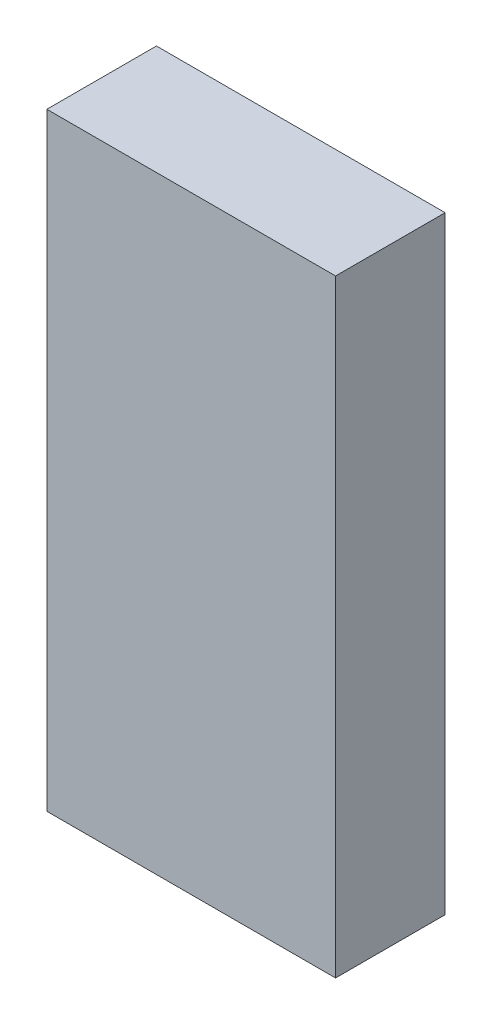
ISO-10303-21;
HEADER;
FILE_DESCRIPTION(('STEP AP214'),'2;1');
FILE_NAME('part.step','',(''),(''),'','','');
FILE_SCHEMA(('AUTOMOTIVE_DESIGN { 1 0 10303 214 1 1 1 1 }'));
ENDSEC;
DATA;
#1=APPLICATION_CONTEXT('core data for automotive mechanical design processes');
#2=APPLICATION_PROTOCOL_DEFINITION('international standard','automotive_design',2000,#1);
#3=PRODUCT_CONTEXT('',#1,'mechanical');
#4=PRODUCT('Part','Part','',(#3));
#5=PRODUCT_RELATED_PRODUCT_CATEGORY('part','',(#4));
#6=PRODUCT_DEFINITION_FORMATION('','',#4);
#7=PRODUCT_DEFINITION_CONTEXT('part definition',#1,'design');
#8=PRODUCT_DEFINITION('design','',#6,#7);
#9=PRODUCT_DEFINITION_SHAPE('','',#8);
#10=(LENGTH_UNIT() NAMED_UNIT(*) SI_UNIT(.MILLI.,.METRE.));
#11=(NAMED_UNIT(*) PLANE_ANGLE_UNIT() SI_UNIT($,.RADIAN.));
#12=(NAMED_UNIT(*) SI_UNIT($,.STERADIAN.) SOLID_ANGLE_UNIT());
#13=UNCERTAINTY_MEASURE_WITH_UNIT(LENGTH_MEASURE(1.E-05),#10,'distance_accuracy_value','');
#14=(GEOMETRIC_REPRESENTATION_CONTEXT(3) GLOBAL_UNCERTAINTY_ASSIGNED_CONTEXT((#13)) GLOBAL_UNIT_ASSIGNED_CONTEXT((#10,
#11,#12)) REPRESENTATION_CONTEXT('',''));
#15=CARTESIAN_POINT('',(0.,0.,0.));
#16=DIRECTION('',(0.,0.,1.));
#17=DIRECTION('',(1.,0.,0.));
#18=AXIS2_PLACEMENT_3D('',#15,#16,#17);
#19=CARTESIAN_POINT('',(0.,0.,6.35));
#20=DIRECTION('',(1.,0.,0.));
#21=DIRECTION('',(0.,0.,-1.));
#22=AXIS2_PLACEMENT_3D('',#19,#20,#21);
#23=PLANE('',#22);
#24=DIRECTION('',(0.,-1.,0.));
#25=VECTOR('',#24,1.);
#26=CARTESIAN_POINT('',(0.,0.,0.));
#27=LINE('',#26,#25);
#28=CARTESIAN_POINT('',(0.,0.,0.));
#29=VERTEX_POINT('',#28);
#30=CARTESIAN_POINT('',(0.,-35.2362745098039,0.));
#31=VERTEX_POINT('',#30);
#32=EDGE_CURVE('E102',#29,#31,#27,.T.);
#33=ORIENTED_EDGE('',*,*,#32,.T.);
#34=DIRECTION('',(0.,0.,-1.));
#35=VECTOR('',#34,1.);
#36=CARTESIAN_POINT('',(0.,-35.2362745098039,6.35));
#37=LINE('',#36,#35);
#38=CARTESIAN_POINT('',(0.,-35.2362745098039,6.35));
#39=VERTEX_POINT('',#38);
#40=EDGE_CURVE('E11',#39,#31,#37,.T.);
#41=ORIENTED_EDGE('',*,*,#40,.F.);
#42=DIRECTION('',(0.,-1.,0.));
#43=VECTOR('',#42,1.);
#44=CARTESIAN_POINT('',(0.,0.,6.35));
#45=LINE('',#44,#43);
#46=CARTESIAN_POINT('',(0.,0.,6.35));
#47=VERTEX_POINT('',#46);
#48=EDGE_CURVE('E90',#47,#39,#45,.T.);
#49=ORIENTED_EDGE('',*,*,#48,.F.);
#50=DIRECTION('',(0.,0.,-1.));
#51=VECTOR('',#50,1.);
#52=CARTESIAN_POINT('',(0.,0.,6.35));
#53=LINE('',#52,#51);
#54=EDGE_CURVE('E98',#47,#29,#53,.T.);
#55=ORIENTED_EDGE('',*,*,#54,.T.);
#56=EDGE_LOOP('',(#33,#41,#49,#55));
#57=FACE_BOUND('',#56,.T.);
#58=ADVANCED_FACE('F39',(#57),#23,.F.);
#59=CARTESIAN_POINT('',(0.,-35.2362745098039,6.35));
#60=DIRECTION('',(0.,1.,0.));
#61=DIRECTION('',(0.,0.,1.));
#62=AXIS2_PLACEMENT_3D('',#59,#60,#61);
#63=PLANE('',#62);
#64=DIRECTION('',(1.,0.,0.));
#65=VECTOR('',#64,1.);
#66=CARTESIAN_POINT('',(0.,-35.2362745098039,0.));
#67=LINE('',#66,#65);
#68=CARTESIAN_POINT('',(16.7322668256492,-35.2362745098039,0.));
#69=VERTEX_POINT('',#68);
#70=EDGE_CURVE('E94',#31,#69,#67,.T.);
#71=ORIENTED_EDGE('',*,*,#70,.T.);
#72=DIRECTION('',(0.,0.,-1.));
#73=VECTOR('',#72,1.);
#74=CARTESIAN_POINT('',(16.7322668256492,-35.2362745098039,6.35));
#75=LINE('',#74,#73);
#76=CARTESIAN_POINT('',(16.7322668256492,-35.2362745098039,6.35));
#77=VERTEX_POINT('',#76);
#78=EDGE_CURVE('E47',#77,#69,#75,.T.);
#79=ORIENTED_EDGE('',*,*,#78,.F.);
#80=DIRECTION('',(1.,0.,0.));
#81=VECTOR('',#80,1.);
#82=CARTESIAN_POINT('',(0.,-35.2362745098039,6.35));
#83=LINE('',#82,#81);
#84=EDGE_CURVE('E85',#39,#77,#83,.T.);
#85=ORIENTED_EDGE('',*,*,#84,.F.);
#86=ORIENTED_EDGE('',*,*,#40,.T.);
#87=EDGE_LOOP('',(#71,#79,#85,#86));
#88=FACE_BOUND('',#87,.T.);
#89=ADVANCED_FACE('F93',(#88),#63,.F.);
#90=CARTESIAN_POINT('',(16.7322668256492,0.,6.35));
#91=DIRECTION('',(-1.,0.,0.));
#92=DIRECTION('',(0.,0.,1.));
#93=AXIS2_PLACEMENT_3D('',#90,#91,#92);
#94=PLANE('',#93);
#95=DIRECTION('',(0.,1.,0.));
#96=VECTOR('',#95,1.);
#97=CARTESIAN_POINT('',(16.7322668256492,0.,0.));
#98=LINE('',#97,#96);
#99=CARTESIAN_POINT('',(16.7322668256492,0.,0.));
#100=VERTEX_POINT('',#99);
#101=EDGE_CURVE('E72',#69,#100,#98,.T.);
#102=ORIENTED_EDGE('',*,*,#101,.T.);
#103=DIRECTION('',(0.,0.,-1.));
#104=VECTOR('',#103,1.);
#105=CARTESIAN_POINT('',(16.7322668256492,0.,6.35));
#106=LINE('',#105,#104);
#107=CARTESIAN_POINT('',(16.7322668256492,0.,6.35));
#108=VERTEX_POINT('',#107);
#109=EDGE_CURVE('E95',#108,#100,#106,.T.);
#110=ORIENTED_EDGE('',*,*,#109,.F.);
#111=DIRECTION('',(0.,1.,0.));
#112=VECTOR('',#111,1.);
#113=CARTESIAN_POINT('',(16.7322668256492,0.,6.35));
#114=LINE('',#113,#112);
#115=EDGE_CURVE('E88',#77,#108,#114,.T.);
#116=ORIENTED_EDGE('',*,*,#115,.F.);
#117=ORIENTED_EDGE('',*,*,#78,.T.);
#118=EDGE_LOOP('',(#102,#110,#116,#117));
#119=FACE_BOUND('',#118,.T.);
#120=ADVANCED_FACE('F96',(#119),#94,.F.);
#121=CARTESIAN_POINT('',(0.,0.,6.35));
#122=DIRECTION('',(0.,-1.,0.));
#123=DIRECTION('',(0.,0.,-1.));
#124=AXIS2_PLACEMENT_3D('',#121,#122,#123);
#125=PLANE('',#124);
#126=DIRECTION('',(-1.,0.,0.));
#127=VECTOR('',#126,1.);
#128=CARTESIAN_POINT('',(0.,0.,0.));
#129=LINE('',#128,#127);
#130=EDGE_CURVE('E78',#100,#29,#129,.T.);
#131=ORIENTED_EDGE('',*,*,#130,.T.);
#132=ORIENTED_EDGE('',*,*,#54,.F.);
#133=DIRECTION('',(-1.,0.,0.));
#134=VECTOR('',#133,1.);
#135=CARTESIAN_POINT('',(0.,0.,6.35));
#136=LINE('',#135,#134);
#137=EDGE_CURVE('E55',#108,#47,#136,.T.);
#138=ORIENTED_EDGE('',*,*,#137,.F.);
#139=ORIENTED_EDGE('',*,*,#109,.T.);
#140=EDGE_LOOP('',(#131,#132,#138,#139));
#141=FACE_BOUND('',#140,.T.);
#142=ADVANCED_FACE('F109',(#141),#125,.F.);
#143=CARTESIAN_POINT('',(0.,0.,6.35));
#144=DIRECTION('',(0.,0.,1.));
#145=DIRECTION('',(1.,0.,0.));
#146=AXIS2_PLACEMENT_3D('',#143,#144,#145);
#147=PLANE('',#146);
#148=ORIENTED_EDGE('',*,*,#48,.T.);
#149=ORIENTED_EDGE('',*,*,#84,.T.);
#150=ORIENTED_EDGE('',*,*,#115,.T.);
#151=ORIENTED_EDGE('',*,*,#137,.T.);
#152=EDGE_LOOP('',(#148,#149,#150,#151));
#153=FACE_BOUND('',#152,.T.);
#154=ADVANCED_FACE('F86',(#153),#147,.T.);
#155=CARTESIAN_POINT('',(0.,0.,0.));
#156=DIRECTION('',(0.,0.,1.));
#157=DIRECTION('',(1.,0.,0.));
#158=AXIS2_PLACEMENT_3D('',#155,#156,#157);
#159=PLANE('',#158);
#160=ORIENTED_EDGE('',*,*,#32,.F.);
#161=ORIENTED_EDGE('',*,*,#130,.F.);
#162=ORIENTED_EDGE('',*,*,#101,.F.);
#163=ORIENTED_EDGE('',*,*,#70,.F.);
#164=EDGE_LOOP('',(#160,#161,#162,#163));
#165=FACE_BOUND('',#164,.T.);
#166=ADVANCED_FACE('F112',(#165),#159,.F.);
#167=CLOSED_SHELL('',(#58,#89,#120,#142,#154,#166));
#168=MANIFOLD_SOLID_BREP('B2',#167);
#169=ADVANCED_BREP_SHAPE_REPRESENTATION('',(#18,#168),#14);
#170=SHAPE_DEFINITION_REPRESENTATION(#9,#169);
ENDSEC;
END-ISO-10303-21;
